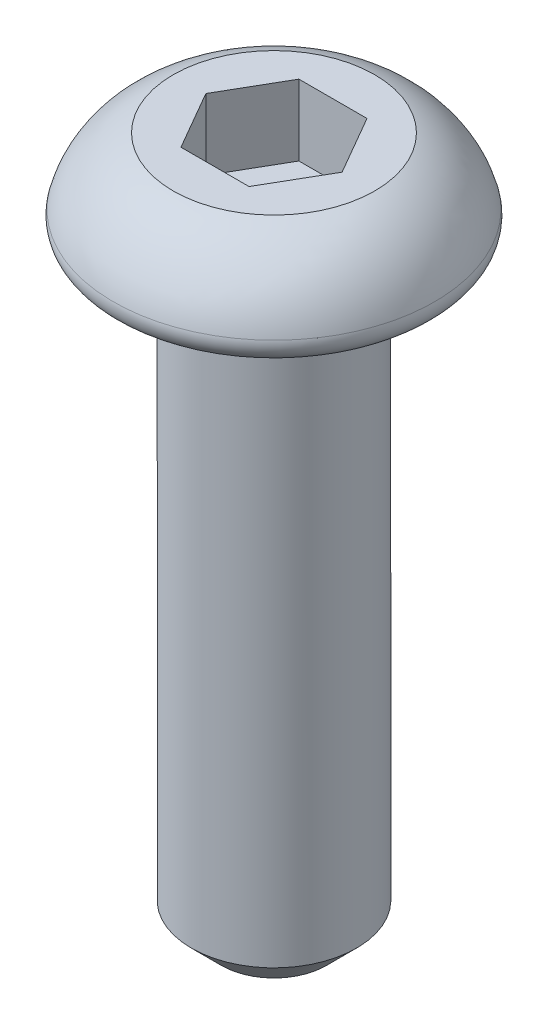
ISO-10303-21;
HEADER;
FILE_DESCRIPTION(('STEP AP214'),'2;1');
FILE_NAME('part.step','',(''),(''),'','','');
FILE_SCHEMA(('AUTOMOTIVE_DESIGN { 1 0 10303 214 1 1 1 1 }'));
ENDSEC;
DATA;
#1=APPLICATION_CONTEXT('core data for automotive mechanical design processes');
#2=APPLICATION_PROTOCOL_DEFINITION('international standard','automotive_design',2000,#1);
#3=PRODUCT_CONTEXT('',#1,'mechanical');
#4=PRODUCT('Part','Part','',(#3));
#5=PRODUCT_RELATED_PRODUCT_CATEGORY('part','',(#4));
#6=PRODUCT_DEFINITION_FORMATION('','',#4);
#7=PRODUCT_DEFINITION_CONTEXT('part definition',#1,'design');
#8=PRODUCT_DEFINITION('design','',#6,#7);
#9=PRODUCT_DEFINITION_SHAPE('','',#8);
#10=(LENGTH_UNIT() NAMED_UNIT(*) SI_UNIT(.MILLI.,.METRE.));
#11=(NAMED_UNIT(*) PLANE_ANGLE_UNIT() SI_UNIT($,.RADIAN.));
#12=(NAMED_UNIT(*) SI_UNIT($,.STERADIAN.) SOLID_ANGLE_UNIT());
#13=UNCERTAINTY_MEASURE_WITH_UNIT(LENGTH_MEASURE(1.E-05),#10,'distance_accuracy_value','');
#14=(GEOMETRIC_REPRESENTATION_CONTEXT(3) GLOBAL_UNCERTAINTY_ASSIGNED_CONTEXT((#13)) GLOBAL_UNIT_ASSIGNED_CONTEXT((#10,
#11,#12)) REPRESENTATION_CONTEXT('',''));
#15=CARTESIAN_POINT('',(0.,0.,0.));
#16=DIRECTION('',(0.,0.,1.));
#17=DIRECTION('',(1.,0.,0.));
#18=AXIS2_PLACEMENT_3D('',#15,#16,#17);
#19=CARTESIAN_POINT('',(0.,0.3048,0.));
#20=DIRECTION('',(0.,1.,0.));
#21=DIRECTION('',(-1.,0.,0.));
#22=AXIS2_PLACEMENT_3D('',#19,#20,#21);
#23=PLANE('',#22);
#24=DIRECTION('',(0.5,0.,0.866025403784439));
#25=VECTOR('',#24,1.);
#26=CARTESIAN_POINT('',(-1.07315,0.3048,0.));
#27=LINE('',#26,#25);
#28=CARTESIAN_POINT('',(-1.07315,0.3048,0.));
#29=VERTEX_POINT('',#28);
#30=CARTESIAN_POINT('',(-0.536575,0.3048,0.92937516207127));
#31=VERTEX_POINT('',#30);
#32=EDGE_CURVE('E85',#29,#31,#27,.T.);
#33=ORIENTED_EDGE('',*,*,#32,.T.);
#34=DIRECTION('',(1.,0.,0.));
#35=VECTOR('',#34,1.);
#36=CARTESIAN_POINT('',(-0.536575,0.304800000000001,0.92937516207127));
#37=LINE('',#36,#35);
#38=CARTESIAN_POINT('',(0.536575,0.3048,0.92937516207127));
#39=VERTEX_POINT('',#38);
#40=EDGE_CURVE('E82',#31,#39,#37,.T.);
#41=ORIENTED_EDGE('',*,*,#40,.T.);
#42=DIRECTION('',(0.5,0.,-0.866025403784439));
#43=VECTOR('',#42,1.);
#44=CARTESIAN_POINT('',(0.536575,0.3048,0.92937516207127));
#45=LINE('',#44,#43);
#46=CARTESIAN_POINT('',(1.07315,0.3048,0.));
#47=VERTEX_POINT('',#46);
#48=EDGE_CURVE('E79',#39,#47,#45,.T.);
#49=ORIENTED_EDGE('',*,*,#48,.T.);
#50=DIRECTION('',(-0.5,0.,-0.866025403784439));
#51=VECTOR('',#50,1.);
#52=CARTESIAN_POINT('',(1.07315,0.3048,0.));
#53=LINE('',#52,#51);
#54=CARTESIAN_POINT('',(0.536575,0.3048,-0.92937516207127));
#55=VERTEX_POINT('',#54);
#56=EDGE_CURVE('E102',#47,#55,#53,.T.);
#57=ORIENTED_EDGE('',*,*,#56,.T.);
#58=DIRECTION('',(-1.,0.,0.));
#59=VECTOR('',#58,1.);
#60=CARTESIAN_POINT('',(0.536575,0.3048,-0.92937516207127));
#61=LINE('',#60,#59);
#62=CARTESIAN_POINT('',(-0.536575,0.3048,-0.92937516207127));
#63=VERTEX_POINT('',#62);
#64=EDGE_CURVE('E384',#55,#63,#61,.T.);
#65=ORIENTED_EDGE('',*,*,#64,.T.);
#66=DIRECTION('',(-0.5,0.,0.866025403784439));
#67=VECTOR('',#66,1.);
#68=CARTESIAN_POINT('',(-0.536575,0.3048,-0.92937516207127));
#69=LINE('',#68,#67);
#70=EDGE_CURVE('E391',#63,#29,#69,.T.);
#71=ORIENTED_EDGE('',*,*,#70,.T.);
#72=EDGE_LOOP('',(#33,#41,#49,#57,#65,#71));
#73=FACE_BOUND('',#72,.T.);
#74=ADVANCED_FACE('F15',(#73),#23,.T.);
#75=CARTESIAN_POINT('',(-0.536575,1.4224,0.92937516207127));
#76=DIRECTION('',(0.,0.,1.));
#77=DIRECTION('',(1.,0.,0.));
#78=AXIS2_PLACEMENT_3D('',#75,#76,#77);
#79=PLANE('',#78);
#80=ORIENTED_EDGE('',*,*,#40,.F.);
#81=DIRECTION('',(0.,1.,0.));
#82=VECTOR('',#81,1.);
#83=CARTESIAN_POINT('',(-0.536575,1.4224,0.929375162071271));
#84=LINE('',#83,#82);
#85=CARTESIAN_POINT('',(-0.536575,1.4224,0.92937516207127));
#86=VERTEX_POINT('',#85);
#87=EDGE_CURVE('E397',#31,#86,#84,.T.);
#88=ORIENTED_EDGE('',*,*,#87,.T.);
#89=DIRECTION('',(1.,0.,0.));
#90=VECTOR('',#89,1.);
#91=CARTESIAN_POINT('',(0.,1.4224,0.92937516207127));
#92=LINE('',#91,#90);
#93=CARTESIAN_POINT('',(0.536575,1.4224,0.92937516207127));
#94=VERTEX_POINT('',#93);
#95=EDGE_CURVE('E93',#86,#94,#92,.T.);
#96=ORIENTED_EDGE('',*,*,#95,.T.);
#97=DIRECTION('',(0.,1.,0.));
#98=VECTOR('',#97,1.);
#99=CARTESIAN_POINT('',(0.536575,1.4224,0.929375162071271));
#100=LINE('',#99,#98);
#101=EDGE_CURVE('E88',#94,#39,#100,.F.);
#102=ORIENTED_EDGE('',*,*,#101,.T.);
#103=EDGE_LOOP('',(#80,#88,#96,#102));
#104=FACE_BOUND('',#103,.T.);
#105=ADVANCED_FACE('F91',(#104),#79,.F.);
#106=CARTESIAN_POINT('',(0.536575,1.4224,0.92937516207127));
#107=DIRECTION('',(0.866025403784439,0.,0.5));
#108=DIRECTION('',(0.5,0.,-0.866025403784439));
#109=AXIS2_PLACEMENT_3D('',#106,#107,#108);
#110=PLANE('',#109);
#111=ORIENTED_EDGE('',*,*,#48,.F.);
#112=ORIENTED_EDGE('',*,*,#101,.F.);
#113=DIRECTION('',(0.5,0.,-0.866025403784439));
#114=VECTOR('',#113,1.);
#115=CARTESIAN_POINT('',(0.536575,1.4224,0.92937516207127));
#116=LINE('',#115,#114);
#117=CARTESIAN_POINT('',(1.07315,1.4224,0.));
#118=VERTEX_POINT('',#117);
#119=EDGE_CURVE('E400',#94,#118,#116,.T.);
#120=ORIENTED_EDGE('',*,*,#119,.T.);
#121=DIRECTION('',(0.,1.,0.));
#122=VECTOR('',#121,1.);
#123=CARTESIAN_POINT('',(1.07315,1.4224,0.));
#124=LINE('',#123,#122);
#125=EDGE_CURVE('E99',#118,#47,#124,.F.);
#126=ORIENTED_EDGE('',*,*,#125,.T.);
#127=EDGE_LOOP('',(#111,#112,#120,#126));
#128=FACE_BOUND('',#127,.T.);
#129=ADVANCED_FACE('F97',(#128),#110,.F.);
#130=CARTESIAN_POINT('',(1.07315,1.4224,0.));
#131=DIRECTION('',(0.866025403784439,0.,-0.5));
#132=DIRECTION('',(-0.5,0.,-0.866025403784439));
#133=AXIS2_PLACEMENT_3D('',#130,#131,#132);
#134=PLANE('',#133);
#135=ORIENTED_EDGE('',*,*,#56,.F.);
#136=ORIENTED_EDGE('',*,*,#125,.F.);
#137=DIRECTION('',(-0.5,0.,-0.866025403784439));
#138=VECTOR('',#137,1.);
#139=CARTESIAN_POINT('',(1.07315,1.4224,0.));
#140=LINE('',#139,#138);
#141=CARTESIAN_POINT('',(0.536575,1.4224,-0.92937516207127));
#142=VERTEX_POINT('',#141);
#143=EDGE_CURVE('E402',#118,#142,#140,.T.);
#144=ORIENTED_EDGE('',*,*,#143,.T.);
#145=DIRECTION('',(0.,1.,0.));
#146=VECTOR('',#145,1.);
#147=CARTESIAN_POINT('',(0.536575,1.4224,-0.92937516207127));
#148=LINE('',#147,#146);
#149=EDGE_CURVE('E382',#142,#55,#148,.F.);
#150=ORIENTED_EDGE('',*,*,#149,.T.);
#151=EDGE_LOOP('',(#135,#136,#144,#150));
#152=FACE_BOUND('',#151,.T.);
#153=ADVANCED_FACE('F231',(#152),#134,.F.);
#154=CARTESIAN_POINT('',(0.536575,1.4224,-0.92937516207127));
#155=DIRECTION('',(0.,0.,-1.));
#156=DIRECTION('',(-1.,0.,0.));
#157=AXIS2_PLACEMENT_3D('',#154,#155,#156);
#158=PLANE('',#157);
#159=ORIENTED_EDGE('',*,*,#64,.F.);
#160=ORIENTED_EDGE('',*,*,#149,.F.);
#161=DIRECTION('',(1.,0.,0.));
#162=VECTOR('',#161,1.);
#163=CARTESIAN_POINT('',(0.,1.4224,-0.92937516207127));
#164=LINE('',#163,#162);
#165=CARTESIAN_POINT('',(-0.536575,1.4224,-0.92937516207127));
#166=VERTEX_POINT('',#165);
#167=EDGE_CURVE('E404',#142,#166,#164,.F.);
#168=ORIENTED_EDGE('',*,*,#167,.T.);
#169=DIRECTION('',(0.,1.,0.));
#170=VECTOR('',#169,1.);
#171=CARTESIAN_POINT('',(-0.536575,1.4224,-0.92937516207127));
#172=LINE('',#171,#170);
#173=EDGE_CURVE('E388',#166,#63,#172,.F.);
#174=ORIENTED_EDGE('',*,*,#173,.T.);
#175=EDGE_LOOP('',(#159,#160,#168,#174));
#176=FACE_BOUND('',#175,.T.);
#177=ADVANCED_FACE('F227',(#176),#158,.F.);
#178=CARTESIAN_POINT('',(-0.536575,1.4224,-0.92937516207127));
#179=DIRECTION('',(-0.866025403784439,0.,-0.5));
#180=DIRECTION('',(-0.5,0.,0.866025403784439));
#181=AXIS2_PLACEMENT_3D('',#178,#179,#180);
#182=PLANE('',#181);
#183=ORIENTED_EDGE('',*,*,#70,.F.);
#184=ORIENTED_EDGE('',*,*,#173,.F.);
#185=DIRECTION('',(-0.5,0.,0.866025403784439));
#186=VECTOR('',#185,1.);
#187=CARTESIAN_POINT('',(-0.536575,1.4224,-0.92937516207127));
#188=LINE('',#187,#186);
#189=CARTESIAN_POINT('',(-1.07315,1.4224,0.));
#190=VERTEX_POINT('',#189);
#191=EDGE_CURVE('E405',#166,#190,#188,.T.);
#192=ORIENTED_EDGE('',*,*,#191,.T.);
#193=DIRECTION('',(0.,1.,0.));
#194=VECTOR('',#193,1.);
#195=CARTESIAN_POINT('',(-1.07315,1.4224,0.));
#196=LINE('',#195,#194);
#197=EDGE_CURVE('E393',#190,#29,#196,.F.);
#198=ORIENTED_EDGE('',*,*,#197,.T.);
#199=EDGE_LOOP('',(#183,#184,#192,#198));
#200=FACE_BOUND('',#199,.T.);
#201=ADVANCED_FACE('F223',(#200),#182,.F.);
#202=CARTESIAN_POINT('',(-1.07315,1.4224,0.));
#203=DIRECTION('',(-0.866025403784439,0.,0.5));
#204=DIRECTION('',(0.5,0.,0.866025403784439));
#205=AXIS2_PLACEMENT_3D('',#202,#203,#204);
#206=PLANE('',#205);
#207=ORIENTED_EDGE('',*,*,#32,.F.);
#208=ORIENTED_EDGE('',*,*,#197,.F.);
#209=DIRECTION('',(0.5,0.,0.866025403784439));
#210=VECTOR('',#209,1.);
#211=CARTESIAN_POINT('',(-1.07315,1.4224,0.));
#212=LINE('',#211,#210);
#213=EDGE_CURVE('E113',#190,#86,#212,.T.);
#214=ORIENTED_EDGE('',*,*,#213,.T.);
#215=ORIENTED_EDGE('',*,*,#87,.F.);
#216=EDGE_LOOP('',(#207,#208,#214,#215));
#217=FACE_BOUND('',#216,.T.);
#218=ADVANCED_FACE('F219',(#217),#206,.F.);
#219=CARTESIAN_POINT('',(0.,1.4224,0.));
#220=DIRECTION('',(0.,-1.,0.));
#221=DIRECTION('',(1.,0.,0.));
#222=AXIS2_PLACEMENT_3D('',#219,#220,#221);
#223=PLANE('',#222);
#224=ORIENTED_EDGE('',*,*,#191,.F.);
#225=ORIENTED_EDGE('',*,*,#167,.F.);
#226=ORIENTED_EDGE('',*,*,#143,.F.);
#227=ORIENTED_EDGE('',*,*,#119,.F.);
#228=ORIENTED_EDGE('',*,*,#95,.F.);
#229=ORIENTED_EDGE('',*,*,#213,.F.);
#230=EDGE_LOOP('',(#224,#225,#226,#227,#228,#229));
#231=FACE_BOUND('',#230,.T.);
#232=CARTESIAN_POINT('',(0.,1.4224,0.));
#233=DIRECTION('',(0.,-1.,0.));
#234=DIRECTION('',(1.,0.,0.));
#235=AXIS2_PLACEMENT_3D('',#232,#233,#234);
#236=CIRCLE('',#235,1.5875);
#237=CARTESIAN_POINT('',(1.5875,1.4224,0.));
#238=VERTEX_POINT('',#237);
#239=EDGE_CURVE('E109',#238,#238,#236,.T.);
#240=ORIENTED_EDGE('',*,*,#239,.F.);
#241=EDGE_LOOP('',(#240));
#242=FACE_BOUND('',#241,.T.);
#243=ADVANCED_FACE('F215',(#231,#242),#223,.F.);
#244=CARTESIAN_POINT('',(-1.06278727428776,0.,0.));
#245=DIRECTION('',(0.,0.,-1.));
#246=DIRECTION('',(-1.,0.,0.));
#247=AXIS2_PLACEMENT_3D('',#244,#245,#246);
#248=CIRCLE('',#247,1.51609538107745);
#249=TRIMMED_CURVE('',#248,(PARAMETER_VALUE(-2.3475991469694)),
(PARAMETER_VALUE(2.3475991469694)),.T.,.PARAMETER.);
#250=CARTESIAN_POINT('',(0.,0.,0.));
#251=DIRECTION('',(0.,-1.,0.));
#252=AXIS1_PLACEMENT('',#250,#251);
#253=SURFACE_OF_REVOLUTION('',#249,#252);
#254=CARTESIAN_POINT('',(0.,0.381000000000001,0.));
#255=DIRECTION('',(0.,-1.,0.));
#256=DIRECTION('',(-1.,0.,0.));
#257=AXIS2_PLACEMENT_3D('',#254,#255,#256);
#258=CIRCLE('',#257,2.53022865455628);
#259=CARTESIAN_POINT('',(-2.53022865455628,0.381000000000001,0.));
#260=VERTEX_POINT('',#259);
#261=EDGE_CURVE('E112',#260,#260,#258,.T.);
#262=ORIENTED_EDGE('',*,*,#261,.F.);
#263=EDGE_LOOP('',(#262));
#264=FACE_BOUND('',#263,.T.);
#265=ORIENTED_EDGE('',*,*,#239,.T.);
#266=EDGE_LOOP('',(#265));
#267=FACE_BOUND('',#266,.T.);
#268=ADVANCED_FACE('F212',(#264,#267),#253,.F.);
#269=CARTESIAN_POINT('',(0.,0.304482497797472,0.));
#270=DIRECTION('',(0.,-1.,0.));
#271=DIRECTION('',(-1.,0.,0.));
#272=AXIS2_PLACEMENT_3D('',#269,#270,#271);
#273=TOROIDAL_SURFACE('',#272,2.23551750220253,0.304482497797472);
#274=CARTESIAN_POINT('',(0.,0.,0.));
#275=DIRECTION('',(0.,1.,0.));
#276=DIRECTION('',(1.,0.,0.));
#277=AXIS2_PLACEMENT_3D('',#274,#275,#276);
#278=CIRCLE('',#277,2.23551750220253);
#279=CARTESIAN_POINT('',(-2.23551750220253,0.,0.));
#280=VERTEX_POINT('',#279);
#281=CARTESIAN_POINT('',(2.23551750220253,0.,0.));
#282=VERTEX_POINT('',#281);
#283=EDGE_CURVE('E143',#280,#282,#278,.F.);
#284=ORIENTED_EDGE('',*,*,#283,.F.);
#285=CARTESIAN_POINT('',(0.,0.,0.));
#286=DIRECTION('',(0.,1.,0.));
#287=DIRECTION('',(-1.,0.,0.));
#288=AXIS2_PLACEMENT_3D('',#285,#286,#287);
#289=CIRCLE('',#288,2.23551750220253);
#290=EDGE_CURVE('E198',#282,#280,#289,.F.);
#291=ORIENTED_EDGE('',*,*,#290,.F.);
#292=EDGE_LOOP('',(#284,#291));
#293=FACE_BOUND('',#292,.T.);
#294=ORIENTED_EDGE('',*,*,#261,.T.);
#295=EDGE_LOOP('',(#294));
#296=FACE_BOUND('',#295,.T.);
#297=ADVANCED_FACE('F156',(#293,#296),#273,.T.);
#298=CARTESIAN_POINT('',(0.,0.,0.));
#299=DIRECTION('',(0.,-1.,0.));
#300=DIRECTION('',(1.,0.,0.));
#301=AXIS2_PLACEMENT_3D('',#298,#299,#300);
#302=PLANE('',#301);
#303=CARTESIAN_POINT('',(1.55575,0.,0.));
#304=CARTESIAN_POINT('',(1.55573961372578,-2.38451873902685E-10,0.00840762893266488));
#305=CARTESIAN_POINT('',(1.5556642339386,-6.16083823803666E-10,0.0168151145763443));
#306=CARTESIAN_POINT('',(1.55536388047578,-1.50050118412887E-09,0.0346460523623624));
#307=CARTESIAN_POINT('',(1.5551218936333,-2.01738983225972E-09,0.0440692186914891));
#308=CARTESIAN_POINT('',(1.55418101430788,-3.24217119468889E-09,0.0711785965379643));
#309=CARTESIAN_POINT('',(1.55326751109673,-3.71949747457758E-09,0.0888578264100338));
#310=CARTESIAN_POINT('',(1.55084510592185,-3.53216764897076E-09,0.124174953762565));
#311=CARTESIAN_POINT('',(1.54933620900387,-2.86752122112518E-09,0.141812851592028));
#312=CARTESIAN_POINT('',(1.54572339930192,-7.8270717518741E-10,0.177027709074258));
#313=CARTESIAN_POINT('',(1.54361948376515,6.37463938301458E-10,0.194604668444719));
#314=CARTESIAN_POINT('',(1.53882163063689,-6.56127692884107E-10,0.229678394744048));
#315=CARTESIAN_POINT('',(1.53612768258673,-3.36996372037856E-09,0.247175160245819));
#316=CARTESIAN_POINT('',(1.53014361596133,-8.52224847853238E-09,0.282066392873861));
#317=CARTESIAN_POINT('',(1.52685347901071,-1.09606887173487E-08,0.29946085682999));
#318=CARTESIAN_POINT('',(1.51969509709982,-5.35613454740546E-08,0.334232433356854));
#319=CARTESIAN_POINT('',(1.51582374496914,-9.39328549123501E-08,0.351608913828439));
#320=CARTESIAN_POINT('',(1.5100704361618,-9.7625442422047E-08,0.375209289205929));
#321=CARTESIAN_POINT('',(1.50848677826646,-9.35994861042861E-08,0.381506434843835));
#322=CARTESIAN_POINT('',(1.50279193890413,-7.85875752808505E-08,0.40356063617137));
#323=CARTESIAN_POINT('',(1.49847048098895,-6.62609716290015E-08,0.41926359161058));
#324=CARTESIAN_POINT('',(1.48659193949446,-3.78836659225594E-08,0.459915835187302));
#325=CARTESIAN_POINT('',(1.47865031225425,-2.40423603062954E-08,0.484754413405902));
#326=CARTESIAN_POINT('',(1.46717694403646,-1.11159565121244E-08,0.517748958993895));
#327=CARTESIAN_POINT('',(1.46419284141222,-8.32033459080138E-09,0.526098972111359));
#328=CARTESIAN_POINT('',(1.45674401462226,-3.36609288790632E-09,0.546399963850785));
#329=CARTESIAN_POINT('',(1.45220410201401,-2.02509179486913E-09,0.558323508781904));
#330=CARTESIAN_POINT('',(1.44100546560067,-2.3869933633711E-10,0.586707366566246));
#331=CARTESIAN_POINT('',(1.4342133998338,-3.49924312655092E-10,0.603115172703156));
#332=CARTESIAN_POINT('',(1.42000421962175,-9.26332457383148E-10,0.635875615526423));
#333=CARTESIAN_POINT('',(1.41258098294835,-1.39544645939227E-09,0.652225599576393));
#334=CARTESIAN_POINT('',(1.40066460752132,-7.28150293515777E-09,0.677336478533688));
#335=CARTESIAN_POINT('',(1.39636292019343,-1.03672387525375E-08,0.686188684533612));
#336=CARTESIAN_POINT('',(1.38838142312598,-1.84282603350617E-08,0.702227268905046));
#337=CARTESIAN_POINT('',(1.38472875636018,-2.29644013517907E-08,0.709427166669516));
#338=CARTESIAN_POINT('',(1.37289340582754,-3.82577155318512E-08,0.732307590252477));
#339=CARTESIAN_POINT('',(1.36449574281056,-4.99907714124715E-08,0.747877636882324));
#340=CARTESIAN_POINT('',(1.34716987605699,-7.276548951078E-08,0.77871977120874));
#341=CARTESIAN_POINT('',(1.33824165678267,-8.38071314604369E-08,0.793991850161693));
#342=CARTESIAN_POINT('',(1.31986455791189,-1.02273967540784E-07,0.824220003476693));
#343=CARTESIAN_POINT('',(1.31041566870089,-1.09699094864936E-07,0.839176071996315));
#344=CARTESIAN_POINT('',(1.29100870920522,-1.19389964775728E-07,0.868754240431305));
#345=CARTESIAN_POINT('',(1.28105063502871,-1.21655667921237E-07,0.883376337792792));
#346=CARTESIAN_POINT('',(1.26063717583003,-1.2055577082553E-07,0.912269122784859));
#347=CARTESIAN_POINT('',(1.25018179239071,-1.17190188506387E-07,0.926539811533683));
#348=CARTESIAN_POINT('',(1.22878614184316,-1.05521278264948E-07,0.954712599970502));
#349=CARTESIAN_POINT('',(1.21784588152997,-9.72180195188636E-08,0.968614704819461));
#350=CARTESIAN_POINT('',(1.1954939171198,-7.74662908331695E-08,0.996034140853255));
#351=CARTESIAN_POINT('',(1.1840822247387,-6.60178990155427E-08,1.00955148158605));
#352=CARTESIAN_POINT('',(1.1607997669948,-4.3039172351501E-08,1.03618365557647));
#353=CARTESIAN_POINT('',(1.14892901801917,-3.15088404421127E-08,1.04929850317217));
#354=CARTESIAN_POINT('',(1.1247475225868,-1.2079959108852E-08,1.07511597348826));
#355=CARTESIAN_POINT('',(1.11243679661269,-4.18124085608615E-09,1.08781861534602));
#356=CARTESIAN_POINT('',(1.09551002175424,-4.72353057339087E-10,1.10467176583304));
#357=CARTESIAN_POINT('',(1.09108870547009,-1.42936438102022E-10,1.10901909379956));
#358=CARTESIAN_POINT('',(1.08353103240282,3.39989059605116E-11,1.11638387545015));
#359=CARTESIAN_POINT('',(1.08040452846844,-4.10066858345902E-12,1.11941144059018));
#360=CARTESIAN_POINT('',(1.06646976859913,-1.80223624029178E-10,1.13279822384391));
#361=CARTESIAN_POINT('',(1.05553149109515,-3.35237147501604E-10,1.14302225513841));
#362=CARTESIAN_POINT('',(1.02108750303765,-8.93698433461252E-09,1.17430077068934));
#363=CARTESIAN_POINT('',(0.997079879922048,-2.63767381152909E-08,1.1948095237928));
#364=CARTESIAN_POINT('',(0.96040855446666,-6.81733658168465E-08,1.22425305565372));
#365=CARTESIAN_POINT('',(0.948198463893999,-8.44765294358737E-08,1.23376005300868));
#366=CARTESIAN_POINT('',(0.921565192250497,-1.17803779728684E-07,1.25385796741046));
#367=CARTESIAN_POINT('',(0.907094377418344,-1.34542310307055E-07,1.26438606746524));
#368=CARTESIAN_POINT('',(0.878493402005539,-1.56780476952175E-07,1.28443623757976));
#369=CARTESIAN_POINT('',(0.86438006251266,-1.62779464811078E-07,1.29398234081511));
#370=CARTESIAN_POINT('',(0.836332529110228,-1.63806839761807E-07,1.31227824655403));
#371=CARTESIAN_POINT('',(0.822408827561693,-1.59204900007036E-07,1.32104413714565));
#372=CARTESIAN_POINT('',(0.793207921302455,-1.45640135029186E-07,1.33878291398046));
#373=CARTESIAN_POINT('',(0.777908924562176,-1.36369389829629E-07,1.34771994820813));
#374=CARTESIAN_POINT('',(0.747012527255609,-1.13328870635673E-07,1.36506118358782));
#375=CARTESIAN_POINT('',(0.731415136820256,-9.95592491308797E-08,1.37346540278809));
#376=CARTESIAN_POINT('',(0.699940126690145,-7.10849632323529E-08,1.38972942968541));
#377=CARTESIAN_POINT('',(0.68406251955639,-5.63803406744871E-08,1.39758926170778));
#378=CARTESIAN_POINT('',(0.652048767368667,-2.93285526950137E-08,1.41276219901194));
#379=CARTESIAN_POINT('',(0.635912636721548,-1.6981256397589E-08,1.4200753346319));
#380=CARTESIAN_POINT('',(0.606770326861591,-3.78819301538235E-09,1.43266027357806));
#381=CARTESIAN_POINT('',(0.593810745428518,-1.08516525695289E-09,1.43804041421535));
#382=CARTESIAN_POINT('',(0.570053695362734,8.46716290153949E-10,1.44758292403693));
#383=CARTESIAN_POINT('',(0.55927547090098,6.0154274820654E-10,1.4517934325779));
#384=CARTESIAN_POINT('',(0.529227209187626,-1.97953780356045E-09,1.46315011999196));
#385=CARTESIAN_POINT('',(0.509858831227728,-5.79040693983798E-09,1.47003851073537));
#386=CARTESIAN_POINT('',(0.472554937513352,-2.42108447972396E-08,1.48248330940686));
#387=CARTESIAN_POINT('',(0.454640641923592,-3.78563579885655E-08,1.4881034108796));
#388=CARTESIAN_POINT('',(0.429912900856614,-6.22004653547343E-08,1.4953715289216));
#389=CARTESIAN_POINT('',(0.423181179729171,-6.93831681366284E-08,1.497300799654));
#390=CARTESIAN_POINT('',(0.398332342409116,-9.61913538275516E-08,1.50423903475821));
#391=CARTESIAN_POINT('',(0.380134369343361,-1.16399331011051E-07,1.50896247669635));
#392=CARTESIAN_POINT('',(0.345537731758876,-1.48875872327757E-07,1.51726740459339));
#393=CARTESIAN_POINT('',(0.329155355289488,-1.61763393132018E-07,1.52091703000299));
#394=CARTESIAN_POINT('',(0.305051880770048,-1.70933479146171E-07,1.52587013436289));
#395=CARTESIAN_POINT('',(0.297374088399815,-1.72407136180566E-07,1.52738628808321));
#396=CARTESIAN_POINT('',(0.281209134916655,-1.73019187301278E-07,1.53044975756545));
#397=CARTESIAN_POINT('',(0.272719568650617,-1.71903113117575E-07,1.53198437848322));
#398=CARTESIAN_POINT('',(0.246762293772707,-1.66299790527522E-07,1.536451952094));
#399=CARTESIAN_POINT('',(0.229254553157905,-1.59500134877099E-07,1.53915561391493));
#400=CARTESIAN_POINT('',(0.194157159816422,-1.3992031837004E-07,1.54395764899975));
#401=CARTESIAN_POINT('',(0.176567509556266,-1.27140336459276E-07,1.54605604037177));
#402=CARTESIAN_POINT('',(0.141326858704755,-9.86169561625519E-08,1.54964355773207));
#403=CARTESIAN_POINT('',(0.123675860688216,-8.28736807088277E-08,1.55113270898654));
#404=CARTESIAN_POINT('',(0.088334291070478,-5.18516345240554E-08,1.55350679202863));
#405=CARTESIAN_POINT('',(0.0706437216175889,-3.65728392036449E-08,1.55439175585507));
#406=CARTESIAN_POINT('',(0.031106192407058,-1.03822063584513E-08,1.55566396166988));
#407=CARTESIAN_POINT('',(0.00925370502843628,-1.32437584918084E-09,1.55588663337557));
#408=CARTESIAN_POINT('',(-0.0185196014217449,3.46193229101381E-10,1.5556452265463));
#409=CARTESIAN_POINT('',(-0.024446375356414,1.32667798199067E-10,1.55556333659556));
#410=CARTESIAN_POINT('',(-0.0465933007366182,-4.71653145472927E-10,1.55513848141269));
#411=CARTESIAN_POINT('',(-0.0628099673732107,-5.26069490862247E-10,1.55458910651857));
#412=CARTESIAN_POINT('',(-0.107743695068388,-9.82908465304441E-09,1.55236394543973));
#413=CARTESIAN_POINT('',(-0.136436233352121,-2.61503857386628E-08,1.55014576812655));
#414=CARTESIAN_POINT('',(-0.182855549301542,-6.79574623273057E-08,1.54525896950104));
#415=CARTESIAN_POINT('',(-0.200635466099541,-8.76626456216711E-08,1.54307601188112));
#416=CARTESIAN_POINT('',(-0.235878539068115,-1.2478629126282E-07,1.53812167805022));
#417=CARTESIAN_POINT('',(-0.253342809735186,-1.42231133538335E-07,1.53535831392305));
#418=CARTESIAN_POINT('',(-0.285353576699108,-1.64336586297084E-07,1.52972243041436));
#419=CARTESIAN_POINT('',(-0.299915978537471,-1.7060634388441E-07,1.52693954354793));
#420=CARTESIAN_POINT('',(-0.332566130470159,-1.75037862684559E-07,1.52020671501331));
#421=CARTESIAN_POINT('',(-0.350629685483702,-1.70794645482686E-07,1.51613866709882));
#422=CARTESIAN_POINT('',(-0.385815461498101,-1.56389562274273E-07,1.50754612135853));
#423=CARTESIAN_POINT('',(-0.402944434952779,-1.46493334426446E-07,1.50304919590601));
#424=CARTESIAN_POINT('',(-0.437036596982887,-1.21431101284532E-07,1.49346730954115));
#425=CARTESIAN_POINT('',(-0.453999791650148,-1.06265290384718E-07,1.48838237032517));
#426=CARTESIAN_POINT('',(-0.48773937363981,-7.46669314856542E-08,1.47762974928341));
#427=CARTESIAN_POINT('',(-0.50451577009566,-5.82344457341478E-08,1.47196209608916));
#428=CARTESIAN_POINT('',(-0.537863844046002,-2.87678113908678E-08,1.46005551113119));
#429=CARTESIAN_POINT('',(-0.554435534034399,-1.57334544141999E-08,1.4538166144298));
#430=CARTESIAN_POINT('',(-0.582003624607241,-2.76108844243015E-09,1.44287751524749));
#431=CARTESIAN_POINT('',(-0.593063052522283,5.51934428279574E-11,1.43833552160736));
#432=CARTESIAN_POINT('',(-0.605871617080571,-5.59799560027375E-11,1.43292004601701));
#433=CARTESIAN_POINT('',(-0.607667865142472,-1.49183374894269E-10,1.43215702064229));
#434=CARTESIAN_POINT('',(-0.620658524141413,-6.08490524752125E-10,1.42661460103962));
#435=CARTESIAN_POINT('',(-0.631807548617489,1.52391911321792E-10,1.42172807684868));
#436=CARTESIAN_POINT('',(-0.66246395870431,-7.48627549182984E-10,1.4078591883716));
#437=CARTESIAN_POINT('',(-0.681847417484614,-4.70651734679887E-09,1.39860065246815));
#438=CARTESIAN_POINT('',(-0.714728927770263,-2.17738491185856E-08,1.38205904060942));
#439=CARTESIAN_POINT('',(-0.728324377121956,-3.19414633296816E-08,1.37496851083727));
#440=CARTESIAN_POINT('',(-0.750171252379551,-5.29243380652284E-08,1.36315944329555));
#441=CARTESIAN_POINT('',(-0.758489361270879,-6.20238409560414E-08,1.358563942953));
#442=CARTESIAN_POINT('',(-0.783074997972908,-8.97348918408283E-08,1.34468253774132));
#443=CARTESIAN_POINT('',(-0.79921833943613,-1.09002835510624E-07,1.33517529194209));
#444=CARTESIAN_POINT('',(-0.829126002879474,-1.40130683686514E-07,1.31681711102504));
#445=CARTESIAN_POINT('',(-0.842932860564351,-1.52619494148044E-07,1.30803537245425));
#446=CARTESIAN_POINT('',(-0.861457837452648,-1.610235259184E-07,1.2958288462496));
#447=CARTESIAN_POINT('',(-0.866303163536414,-1.62432564728185E-07,1.29259610713798));
#448=CARTESIAN_POINT('',(-0.879989508523017,-1.64730888345426E-07,1.28335148222626));
#449=CARTESIAN_POINT('',(-0.888786528983614,-1.64202275459273E-07,1.27727431097323));
#450=CARTESIAN_POINT('',(-0.91197935959807,-1.59592430183495E-07,1.26089297949878));
#451=CARTESIAN_POINT('',(-0.926263601690517,-1.53408786440666E-07,1.25043032030655));
#452=CARTESIAN_POINT('',(-0.954462217635791,-1.3467420755795E-07,1.22901914334998));
#453=CARTESIAN_POINT('',(-0.968376602615207,-1.22123464191266E-07,1.21807064022805));
#454=CARTESIAN_POINT('',(-0.995818005894664,-9.38508027217099E-08,1.19569966164691));
#455=CARTESIAN_POINT('',(-1.00934504064054,-7.81290194811603E-08,1.18427720636099));
#456=CARTESIAN_POINT('',(-1.0359998764675,-4.72004567208314E-08,1.16097697211797));
#457=CARTESIAN_POINT('',(-1.04912769943534,-3.1993648962361E-08,1.14909921820357));
#458=CARTESIAN_POINT('',(-1.07646042718209,-8.57471482844481E-09,1.12346989020849));
#459=CARTESIAN_POINT('',(-1.09061209551125,-1.38673953728503E-09,1.10966146897066));
#460=CARTESIAN_POINT('',(-1.11000660171114,5.01631950799826E-10,1.09007933586143));
#461=CARTESIAN_POINT('',(-1.11545325295891,1.28871411988658E-10,1.0845053605173));
#462=CARTESIAN_POINT('',(-1.13291936051658,-5.85847531932011E-10,1.0663742890169));
#463=CARTESIAN_POINT('',(-1.1447802842505,-3.25575048842902E-10,1.05366362526748));
#464=CARTESIAN_POINT('',(-1.17369044713838,-9.48392278349068E-09,1.02162609979272));
#465=CARTESIAN_POINT('',(-1.19048213892129,-2.36325866088257E-08,1.00206569455427));
#466=CARTESIAN_POINT('',(-1.21966038912944,-6.34084584208071E-08,0.966315932641905));
#467=CARTESIAN_POINT('',(-1.23223326455653,-8.60127916017242E-08,0.950278057689931));
#468=CARTESIAN_POINT('',(-1.25494153420251,-1.26057491980807E-07,0.920093929451502));
#469=CARTESIAN_POINT('',(-1.26516464165193,-1.43769782941002E-07,0.906013714618548));
#470=CARTESIAN_POINT('',(-1.28240127252356,-1.65204322820663E-07,0.881400537238074));
#471=CARTESIAN_POINT('',(-1.28952960385792,-1.71424844652671E-07,0.870947669773042));
#472=CARTESIAN_POINT('',(-1.30790544273651,-1.79593204261251E-07,0.843270177196858));
#473=CARTESIAN_POINT('',(-1.31893841684202,-1.76429381988419E-07,0.825902286175551));
#474=CARTESIAN_POINT('',(-1.33880752170546,-1.62250144537882E-07,0.793195551035493));
#475=CARTESIAN_POINT('',(-1.34773524801886,-1.52393174087341E-07,0.777912148015035));
#476=CARTESIAN_POINT('',(-1.36505801447985,-1.26811303082781E-07,0.74704675977432));
#477=CARTESIAN_POINT('',(-1.37345307457765,-1.110866224472E-07,0.731464785765094));
#478=CARTESIAN_POINT('',(-1.38969886944611,-7.79929709333417E-08,0.700020911944829));
#479=CARTESIAN_POINT('',(-1.39754963172632,-6.06240832606468E-08,0.684159026331815));
#480=CARTESIAN_POINT('',(-1.41270368754353,-2.9586581463279E-08,0.652176485243874));
#481=CARTESIAN_POINT('',(-1.42000701591264,-1.59177317678659E-08,0.63605584631228));
#482=CARTESIAN_POINT('',(-1.43093747117242,-3.27658581055078E-09,0.610739432972921));
#483=CARTESIAN_POINT('',(-1.43476383802677,-4.79914139336651E-10,0.601629186789489));
#484=CARTESIAN_POINT('',(-1.43948484944569,7.06561293329915E-11,0.590129954343147));
#485=CARTESIAN_POINT('',(-1.44044837562964,2.64794489410555E-11,0.587769063045385));
#486=CARTESIAN_POINT('',(-1.44626113803593,-1.59181800844807E-10,0.573436288946389));
#487=CARTESIAN_POINT('',(-1.45098237495357,3.38876349294974E-11,0.561412205698201));
#488=CARTESIAN_POINT('',(-1.46362892789857,-9.45896574569307E-10,0.527981115417625));
#489=CARTESIAN_POINT('',(-1.47123404607731,-3.28010693506924E-09,0.506451658372737));
#490=CARTESIAN_POINT('',(-1.48227141796459,-1.13843976757099E-08,0.472888860523003));
#491=CARTESIAN_POINT('',(-1.4860356556267,-1.51237664364873E-08,0.460963285104611));
#492=CARTESIAN_POINT('',(-1.49295986575922,-2.34832095942495E-08,0.438064859797992));
#493=CARTESIAN_POINT('',(-1.49614392154239,-2.79984733468395E-08,0.427099303949182));
#494=CARTESIAN_POINT('',(-1.50409551711612,-3.91018411150674E-08,0.398532128068263));
#495=CARTESIAN_POINT('',(-1.50867343597311,-4.53179485560503E-08,0.38087739273555));
#496=CARTESIAN_POINT('',(-1.51678133762613,-5.29903789896514E-08,0.347151219746997));
#497=CARTESIAN_POINT('',(-1.52037002899059,-5.48529269730039E-08,0.331093892236213));
#498=CARTESIAN_POINT('',(-1.52456309895182,-5.31437919364705E-08,0.310797290267183));
#499=CARTESIAN_POINT('',(-1.52541035919535,-5.25739024705793E-08,0.306607407011013));
#500=CARTESIAN_POINT('',(-1.52872162245129,-5.00142485121567E-08,0.289875348489261));
#501=CARTESIAN_POINT('',(-1.53104748377249,-4.74558604893629E-08,0.277305533384764));
#502=CARTESIAN_POINT('',(-1.53622886089035,-4.12223560642673E-08,0.24723296063148));
#503=CARTESIAN_POINT('',(-1.53894059042416,-3.74985189523565E-08,0.229705311022283));
#504=CARTESIAN_POINT('',(-1.5437613873766,-2.97637925702036E-08,0.194567747625096));
#505=CARTESIAN_POINT('',(-1.54587046469905,-2.5752908018573E-08,0.176957835193824));
#506=CARTESIAN_POINT('',(-1.54948373244656,-1.80683919299733E-08,0.141676379767999));
#507=CARTESIAN_POINT('',(-1.550987934743,-1.43947537752433E-08,0.124004837989859));
#508=CARTESIAN_POINT('',(-1.55338960361924,-7.93726424967826E-09,0.0886209861587937));
#509=CARTESIAN_POINT('',(-1.55428708404381,-5.15339257605467E-09,0.0709086770453913));
#510=CARTESIAN_POINT('',(-1.55547444265625,-1.19243310848714E-09,0.0354641674626996));
#511=CARTESIAN_POINT('',(-1.55576433664879,-1.53035198902267E-11,0.0177319675228201));
#512=CARTESIAN_POINT('',(-1.55575,0.,0.));
#513=B_SPLINE_CURVE_WITH_KNOTS('',3,(#303,#304,#305,#306,#307,#308,#309,#310,#311,#312,#313,
#314,#315,#316,#317,#318,#319,#320,#321,#322,#323,#324,#325,#326,#327,#328,#329,#330,#331,#332,
#333,#334,#335,#336,#337,#338,#339,#340,#341,#342,#343,#344,#345,#346,#347,#348,#349,#350,#351,
#352,#353,#354,#355,#356,#357,#358,#359,#360,#361,#362,#363,#364,#365,#366,#367,#368,#369,#370,
#371,#372,#373,#374,#375,#376,#377,#378,#379,#380,#381,#382,#383,#384,#385,#386,#387,#388,#389,
#390,#391,#392,#393,#394,#395,#396,#397,#398,#399,#400,#401,#402,#403,#404,#405,#406,#407,#408,
#409,#410,#411,#412,#413,#414,#415,#416,#417,#418,#419,#420,#421,#422,#423,#424,#425,#426,#427,
#428,#429,#430,#431,#432,#433,#434,#435,#436,#437,#438,#439,#440,#441,#442,#443,#444,#445,#446,
#447,#448,#449,#450,#451,#452,#453,#454,#455,#456,#457,#458,#459,#460,#461,#462,#463,#464,#465,
#466,#467,#468,#469,#470,#471,#472,#473,#474,#475,#476,#477,#478,#479,#480,#481,#482,#483,#484,
#485,#486,#487,#488,#489,#490,#491,#492,#493,#494,#495,#496,#497,#498,#499,#500,#501,#502,#503,
#504,#505,#506,#507,#508,#509,#510,#511,#512),.UNSPECIFIED.,.F.,.F.,(4,2,2,2,2,2,2,2,2,2,2,2,2,
2,2,2,2,2,2,2,2,2,2,2,2,2,2,2,2,2,2,2,2,2,2,2,2,2,2,2,2,2,2,2,2,2,2,2,2,2,2,2,2,2,2,2,2,2,2,2,2,
2,2,2,2,2,2,2,2,2,2,2,2,2,2,2,2,2,2,2,2,2,2,2,2,2,2,2,2,2,2,2,2,2,2,2,2,2,2,2,2,2,2,2,4),(0.,
0.0252225125479611,0.0535000105051436,0.106597527573567,0.159694594669199,0.212791907417859,
0.26589016142423,0.31899005227118,0.372384649022517,0.391863848732856,0.440716726057108,
0.518909023825321,0.545509982265509,0.58378187373171,0.637045999803838,0.690903721966679,
0.720428317887141,0.744647858257775,0.797707252173636,0.850768200739274,0.903830129443045,
0.956892463776481,1.00995462923458,1.06301605131608,1.11607615552367,1.16913436736436,
1.22219011234981,1.2407916349243,1.25384797271257,1.29876091206146,1.39341534348557,
1.4398347255815,1.49350898111198,1.54461550493639,1.59396694872322,1.64711057317207,
1.70025239650232,1.75339184371552,1.80652833983434,1.84861965546957,1.88333212592174,
1.94498534167771,2.00129773014902,2.0223055801511,2.07869429099962,2.12903690568853,
2.15251426569779,2.17839468290003,2.23152905297481,2.28466183324198,2.33779240978132,
2.39092016869712,2.45645920796198,2.47424118303654,2.52291218086652,2.60919578697397,
2.66292694858674,2.71596012793202,2.76043219850127,2.81596734334559,2.86908540482454,
2.92220150699271,2.97531500055755,3.02842523625452,3.06428940729383,3.07014419372667,
3.10666010031673,3.1710828835783,3.21707655056575,3.24558467072086,3.30177562796523,
3.35085577853939,3.36832978118745,3.40040361240435,3.45351085584494,3.50661649982233,
3.55971988572628,3.6128203549743,3.67212153606947,3.69550105786741,3.74764712964207,
3.82495045051814,3.88607146670831,3.93826111550789,3.97621420854305,4.03792369286282,
4.09101355071997,4.14410141899927,4.197186602186,4.25026840479695,4.27991034629096,
4.2875601638657,4.32631014631124,4.39478400177501,4.43229767625304,4.46655045490991,
4.52125422291348,4.57060527407997,4.58342928703619,4.62177472587429,4.67497253614807,
4.72816947213374,4.78136536401669,4.8345600419833,4.88775333622101),.UNSPECIFIED.);
#514=CARTESIAN_POINT('',(-1.55574999999993,0.,-1.64631726882422E-12));
#515=VERTEX_POINT('',#514);
#516=CARTESIAN_POINT('',(1.55574999999993,0.,3.61646273366347E-12));
#517=VERTEX_POINT('',#516);
#518=EDGE_CURVE('E116',#515,#517,#513,.F.);
#519=ORIENTED_EDGE('',*,*,#518,.T.);
#520=CARTESIAN_POINT('',(0.,0.,0.));
#521=DIRECTION('',(0.,-1.,0.));
#522=DIRECTION('',(-1.,0.,-2.8189517822124E-12));
#523=AXIS2_PLACEMENT_3D('',#520,#521,#522);
#524=CIRCLE('',#523,1.55574999999992);
#525=EDGE_CURVE('E34',#517,#515,#524,.F.);
#526=ORIENTED_EDGE('',*,*,#525,.T.);
#527=EDGE_LOOP('',(#519,#526));
#528=FACE_BOUND('',#527,.T.);
#529=ORIENTED_EDGE('',*,*,#283,.T.);
#530=ORIENTED_EDGE('',*,*,#290,.T.);
#531=EDGE_LOOP('',(#529,#530));
#532=FACE_BOUND('',#531,.T.);
#533=ADVANCED_FACE('F148',(#528,#532),#302,.T.);
#534=CARTESIAN_POINT('',(0.,-9.525,0.));
#535=DIRECTION('',(0.,1.,0.));
#536=DIRECTION('',(0.,0.,1.));
#537=AXIS2_PLACEMENT_3D('',#534,#535,#536);
#538=PLANE('',#537);
#539=CARTESIAN_POINT('',(0.,-9.52500000004033,0.));
#540=DIRECTION('',(0.,1.,0.));
#541=DIRECTION('',(0.,0.,1.));
#542=AXIS2_PLACEMENT_3D('',#539,#540,#541);
#543=CIRCLE('',#542,0.829309999959671);
#544=CARTESIAN_POINT('',(0.,-9.52500000004033,0.829309999959671));
#545=VERTEX_POINT('',#544);
#546=EDGE_CURVE('E106',#545,#545,#543,.T.);
#547=ORIENTED_EDGE('',*,*,#546,.F.);
#548=EDGE_LOOP('',(#547));
#549=FACE_BOUND('',#548,.T.);
#550=ADVANCED_FACE('F132',(#549),#538,.F.);
#551=CARTESIAN_POINT('',(0.,-0.254,0.));
#552=DIRECTION('',(0.,1.,0.));
#553=DIRECTION('',(0.999868576473866,0.,0.0162120257871816));
#554=AXIS2_PLACEMENT_3D('',#551,#552,#553);
#555=TOROIDAL_SURFACE('',#554,1.55575,0.254);
#556=ORIENTED_EDGE('',*,*,#525,.F.);
#557=ORIENTED_EDGE('',*,*,#518,.F.);
#558=EDGE_LOOP('',(#556,#557));
#559=FACE_BOUND('',#558,.T.);
#560=CARTESIAN_POINT('',(0.,-0.254,0.));
#561=DIRECTION('',(0.,1.,0.));
#562=DIRECTION('',(0.,0.,1.));
#563=AXIS2_PLACEMENT_3D('',#560,#561,#562);
#564=CIRCLE('',#563,1.30175);
#565=CARTESIAN_POINT('',(0.,-0.254,1.30175));
#566=VERTEX_POINT('',#565);
#567=EDGE_CURVE('E26',#566,#566,#564,.F.);
#568=ORIENTED_EDGE('',*,*,#567,.F.);
#569=EDGE_LOOP('',(#568));
#570=FACE_BOUND('',#569,.T.);
#571=ADVANCED_FACE('F120',(#559,#570),#555,.F.);
#572=CARTESIAN_POINT('',(0.,-9.05256000011038,0.));
#573=DIRECTION('',(0.,1.,0.));
#574=DIRECTION('',(0.,0.,1.));
#575=AXIS2_PLACEMENT_3D('',#572,#573,#574);
#576=CONICAL_SURFACE('',#575,1.30174999988962,0.785398163397448);
#577=CARTESIAN_POINT('',(0.,-9.05256,0.));
#578=DIRECTION('',(0.,1.,0.));
#579=DIRECTION('',(0.,0.,1.));
#580=AXIS2_PLACEMENT_3D('',#577,#578,#579);
#581=CIRCLE('',#580,1.30175);
#582=CARTESIAN_POINT('',(0.,-9.05256,1.30175));
#583=VERTEX_POINT('',#582);
#584=EDGE_CURVE('E10',#583,#583,#581,.T.);
#585=ORIENTED_EDGE('',*,*,#584,.F.);
#586=EDGE_LOOP('',(#585));
#587=FACE_BOUND('',#586,.T.);
#588=ORIENTED_EDGE('',*,*,#546,.T.);
#589=EDGE_LOOP('',(#588));
#590=FACE_BOUND('',#589,.T.);
#591=ADVANCED_FACE('F131',(#587,#590),#576,.T.);
#592=CARTESIAN_POINT('',(0.,0.,0.));
#593=DIRECTION('',(0.,1.,0.));
#594=DIRECTION('',(0.,0.,1.));
#595=AXIS2_PLACEMENT_3D('',#592,#593,#594);
#596=CYLINDRICAL_SURFACE('',#595,1.30175);
#597=ORIENTED_EDGE('',*,*,#567,.T.);
#598=EDGE_LOOP('',(#597));
#599=FACE_BOUND('',#598,.T.);
#600=ORIENTED_EDGE('',*,*,#584,.T.);
#601=EDGE_LOOP('',(#600));
#602=FACE_BOUND('',#601,.T.);
#603=ADVANCED_FACE('F242',(#599,#602),#596,.T.);
#604=CLOSED_SHELL('',(#74,#105,#129,#153,#177,#201,#218,#243,#268,#297,#533,#550,#571,#591,#603));
#605=MANIFOLD_SOLID_BREP('B1',#604);
#606=ADVANCED_BREP_SHAPE_REPRESENTATION('',(#18,#605),#14);
#607=SHAPE_DEFINITION_REPRESENTATION(#9,#606);
ENDSEC;
END-ISO-10303-21;
